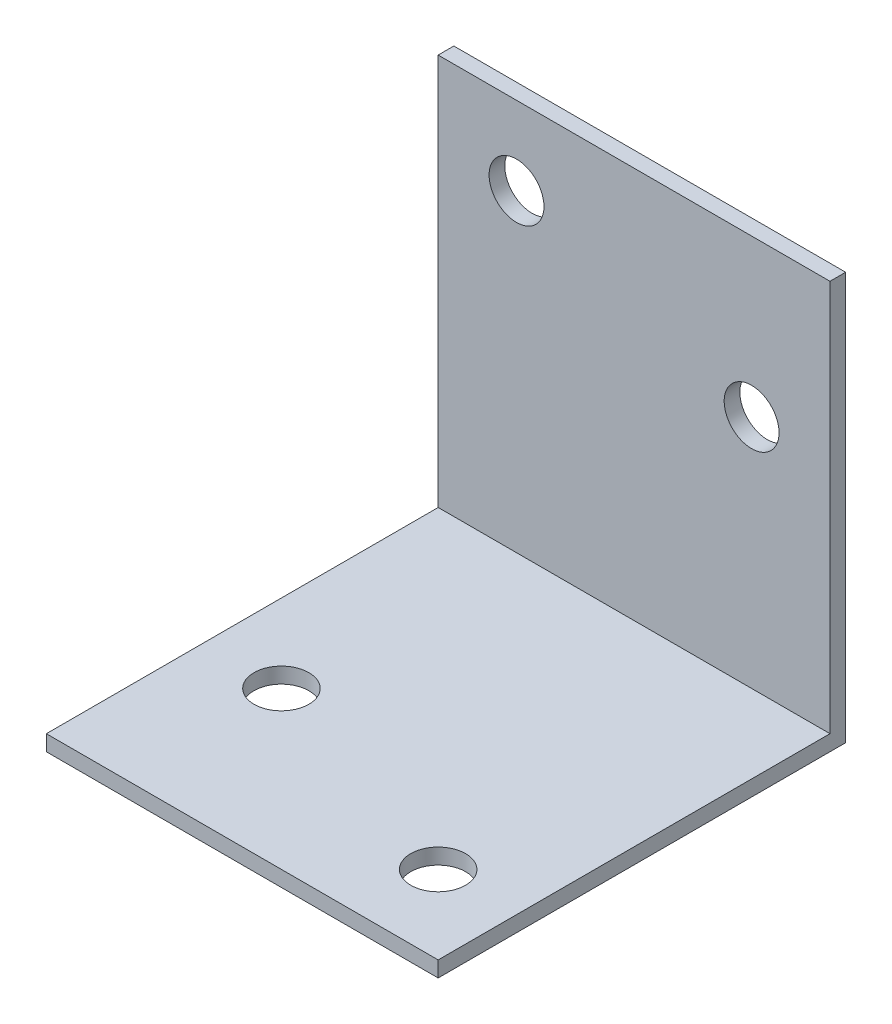
ISO-10303-21;
HEADER;
FILE_DESCRIPTION(('STEP AP214'),'2;1');
FILE_NAME('part.step','',(''),(''),'','','');
FILE_SCHEMA(('AUTOMOTIVE_DESIGN { 1 0 10303 214 1 1 1 1 }'));
ENDSEC;
DATA;
#1=APPLICATION_CONTEXT('core data for automotive mechanical design processes');
#2=APPLICATION_PROTOCOL_DEFINITION('international standard','automotive_design',2000,#1);
#3=PRODUCT_CONTEXT('',#1,'mechanical');
#4=PRODUCT('Part','Part','',(#3));
#5=PRODUCT_RELATED_PRODUCT_CATEGORY('part','',(#4));
#6=PRODUCT_DEFINITION_FORMATION('','',#4);
#7=PRODUCT_DEFINITION_CONTEXT('part definition',#1,'design');
#8=PRODUCT_DEFINITION('design','',#6,#7);
#9=PRODUCT_DEFINITION_SHAPE('','',#8);
#10=(LENGTH_UNIT() NAMED_UNIT(*) SI_UNIT(.MILLI.,.METRE.));
#11=(NAMED_UNIT(*) PLANE_ANGLE_UNIT() SI_UNIT($,.RADIAN.));
#12=(NAMED_UNIT(*) SI_UNIT($,.STERADIAN.) SOLID_ANGLE_UNIT());
#13=UNCERTAINTY_MEASURE_WITH_UNIT(LENGTH_MEASURE(1.E-05),#10,'distance_accuracy_value','');
#14=(GEOMETRIC_REPRESENTATION_CONTEXT(3) GLOBAL_UNCERTAINTY_ASSIGNED_CONTEXT((#13)) GLOBAL_UNIT_ASSIGNED_CONTEXT((#10,
#11,#12)) REPRESENTATION_CONTEXT('',''));
#15=CARTESIAN_POINT('',(0.,0.,0.));
#16=DIRECTION('',(0.,0.,1.));
#17=DIRECTION('',(1.,0.,0.));
#18=AXIS2_PLACEMENT_3D('',#15,#16,#17);
#19=CARTESIAN_POINT('',(0.,0.,1.));
#20=DIRECTION('',(0.,0.,1.));
#21=DIRECTION('',(1.,0.,0.));
#22=AXIS2_PLACEMENT_3D('',#19,#20,#21);
#23=PLANE('',#22);
#24=CARTESIAN_POINT('',(7.5,2.5,1.));
#25=DIRECTION('',(0.,0.,1.));
#26=DIRECTION('',(1.,0.,0.));
#27=AXIS2_PLACEMENT_3D('',#24,#25,#26);
#28=CIRCLE('',#27,1.75);
#29=CARTESIAN_POINT('',(9.25,2.5,1.));
#30=VERTEX_POINT('',#29);
#31=EDGE_CURVE('E105',#30,#30,#28,.T.);
#32=ORIENTED_EDGE('',*,*,#31,.F.);
#33=EDGE_LOOP('',(#32));
#34=FACE_BOUND('',#33,.T.);
#35=DIRECTION('',(0.,1.,0.));
#36=VECTOR('',#35,1.);
#37=CARTESIAN_POINT('',(12.5,12.5,1.));
#38=LINE('',#37,#36);
#39=CARTESIAN_POINT('',(12.5,-12.5,1.));
#40=VERTEX_POINT('',#39);
#41=CARTESIAN_POINT('',(12.5,12.5,1.));
#42=VERTEX_POINT('',#41);
#43=EDGE_CURVE('E90',#40,#42,#38,.T.);
#44=ORIENTED_EDGE('',*,*,#43,.T.);
#45=DIRECTION('',(-1.,0.,0.));
#46=VECTOR('',#45,1.);
#47=CARTESIAN_POINT('',(-12.5,12.5,1.));
#48=LINE('',#47,#46);
#49=CARTESIAN_POINT('',(-12.5,12.5,1.));
#50=VERTEX_POINT('',#49);
#51=EDGE_CURVE('E80',#42,#50,#48,.T.);
#52=ORIENTED_EDGE('',*,*,#51,.T.);
#53=DIRECTION('',(0.,-1.,0.));
#54=VECTOR('',#53,1.);
#55=CARTESIAN_POINT('',(-12.5,12.5,1.));
#56=LINE('',#55,#54);
#57=CARTESIAN_POINT('',(-12.5,-12.5,0.999999999999999));
#58=VERTEX_POINT('',#57);
#59=EDGE_CURVE('E89',#50,#58,#56,.T.);
#60=ORIENTED_EDGE('',*,*,#59,.T.);
#61=DIRECTION('',(1.,0.,0.));
#62=VECTOR('',#61,1.);
#63=CARTESIAN_POINT('',(-12.5,-12.5,1.));
#64=LINE('',#63,#62);
#65=EDGE_CURVE('E69',#58,#40,#64,.T.);
#66=ORIENTED_EDGE('',*,*,#65,.T.);
#67=EDGE_LOOP('',(#44,#52,#60,#66));
#68=FACE_BOUND('',#67,.T.);
#69=CARTESIAN_POINT('',(-7.5,7.5,1.));
#70=DIRECTION('',(0.,0.,1.));
#71=DIRECTION('',(1.,0.,0.));
#72=AXIS2_PLACEMENT_3D('',#69,#70,#71);
#73=CIRCLE('',#72,1.75);
#74=CARTESIAN_POINT('',(-5.75,7.5,1.));
#75=VERTEX_POINT('',#74);
#76=EDGE_CURVE('E294',#75,#75,#73,.T.);
#77=ORIENTED_EDGE('',*,*,#76,.F.);
#78=EDGE_LOOP('',(#77));
#79=FACE_BOUND('',#78,.T.);
#80=ADVANCED_FACE('F33',(#34,#68,#79),#23,.T.);
#81=CARTESIAN_POINT('',(0.,0.,0.));
#82=DIRECTION('',(0.,0.,1.));
#83=DIRECTION('',(1.,0.,0.));
#84=AXIS2_PLACEMENT_3D('',#81,#82,#83);
#85=PLANE('',#84);
#86=CARTESIAN_POINT('',(7.5,2.5,0.));
#87=DIRECTION('',(0.,0.,1.));
#88=DIRECTION('',(1.,0.,0.));
#89=AXIS2_PLACEMENT_3D('',#86,#87,#88);
#90=CIRCLE('',#89,1.75);
#91=CARTESIAN_POINT('',(9.25,2.5,0.));
#92=VERTEX_POINT('',#91);
#93=EDGE_CURVE('E109',#92,#92,#90,.T.);
#94=ORIENTED_EDGE('',*,*,#93,.T.);
#95=EDGE_LOOP('',(#94));
#96=FACE_BOUND('',#95,.T.);
#97=DIRECTION('',(0.,1.,0.));
#98=VECTOR('',#97,1.);
#99=CARTESIAN_POINT('',(12.5,12.5,0.));
#100=LINE('',#99,#98);
#101=CARTESIAN_POINT('',(12.5,-13.5,0.));
#102=VERTEX_POINT('',#101);
#103=CARTESIAN_POINT('',(12.5,12.5,0.));
#104=VERTEX_POINT('',#103);
#105=EDGE_CURVE('E98',#102,#104,#100,.T.);
#106=ORIENTED_EDGE('',*,*,#105,.F.);
#107=DIRECTION('',(1.,0.,0.));
#108=VECTOR('',#107,1.);
#109=CARTESIAN_POINT('',(-12.5,-13.5,0.));
#110=LINE('',#109,#108);
#111=CARTESIAN_POINT('',(-12.5,-13.5,0.));
#112=VERTEX_POINT('',#111);
#113=EDGE_CURVE('E152',#112,#102,#110,.T.);
#114=ORIENTED_EDGE('',*,*,#113,.F.);
#115=DIRECTION('',(0.,-1.,0.));
#116=VECTOR('',#115,1.);
#117=CARTESIAN_POINT('',(-12.5,12.5,0.));
#118=LINE('',#117,#116);
#119=CARTESIAN_POINT('',(-12.5,12.5,0.));
#120=VERTEX_POINT('',#119);
#121=EDGE_CURVE('E95',#120,#112,#118,.T.);
#122=ORIENTED_EDGE('',*,*,#121,.F.);
#123=DIRECTION('',(-1.,0.,0.));
#124=VECTOR('',#123,1.);
#125=CARTESIAN_POINT('',(-12.5,12.5,0.));
#126=LINE('',#125,#124);
#127=EDGE_CURVE('E65',#104,#120,#126,.T.);
#128=ORIENTED_EDGE('',*,*,#127,.F.);
#129=EDGE_LOOP('',(#106,#114,#122,#128));
#130=FACE_BOUND('',#129,.T.);
#131=CARTESIAN_POINT('',(-7.5,7.5,0.));
#132=DIRECTION('',(0.,0.,1.));
#133=DIRECTION('',(1.,0.,0.));
#134=AXIS2_PLACEMENT_3D('',#131,#132,#133);
#135=CIRCLE('',#134,1.75);
#136=CARTESIAN_POINT('',(-5.75,7.5,0.));
#137=VERTEX_POINT('',#136);
#138=EDGE_CURVE('E148',#137,#137,#135,.T.);
#139=ORIENTED_EDGE('',*,*,#138,.T.);
#140=EDGE_LOOP('',(#139));
#141=FACE_BOUND('',#140,.T.);
#142=ADVANCED_FACE('F187',(#96,#130,#141),#85,.F.);
#143=CARTESIAN_POINT('',(12.5,12.5,1.));
#144=DIRECTION('',(-1.,0.,0.));
#145=DIRECTION('',(0.,-1.,0.));
#146=AXIS2_PLACEMENT_3D('',#143,#144,#145);
#147=PLANE('',#146);
#148=ORIENTED_EDGE('',*,*,#105,.T.);
#149=DIRECTION('',(0.,0.,-1.));
#150=VECTOR('',#149,1.);
#151=CARTESIAN_POINT('',(12.5,12.5,1.));
#152=LINE('',#151,#150);
#153=EDGE_CURVE('E11',#42,#104,#152,.T.);
#154=ORIENTED_EDGE('',*,*,#153,.F.);
#155=ORIENTED_EDGE('',*,*,#43,.F.);
#156=DIRECTION('',(0.,0.,1.));
#157=VECTOR('',#156,1.);
#158=CARTESIAN_POINT('',(12.5,-12.5,0.));
#159=LINE('',#158,#157);
#160=CARTESIAN_POINT('',(12.5,-12.5,26.));
#161=VERTEX_POINT('',#160);
#162=EDGE_CURVE('E52',#40,#161,#159,.T.);
#163=ORIENTED_EDGE('',*,*,#162,.T.);
#164=DIRECTION('',(0.,1.,0.));
#165=VECTOR('',#164,1.);
#166=CARTESIAN_POINT('',(12.5,-13.5,26.));
#167=LINE('',#166,#165);
#168=CARTESIAN_POINT('',(12.5,-13.5,26.));
#169=VERTEX_POINT('',#168);
#170=EDGE_CURVE('E135',#169,#161,#167,.T.);
#171=ORIENTED_EDGE('',*,*,#170,.F.);
#172=DIRECTION('',(0.,0.,1.));
#173=VECTOR('',#172,1.);
#174=CARTESIAN_POINT('',(12.5,-13.5,0.));
#175=LINE('',#174,#173);
#176=EDGE_CURVE('E102',#102,#169,#175,.T.);
#177=ORIENTED_EDGE('',*,*,#176,.F.);
#178=EDGE_LOOP('',(#148,#154,#155,#163,#171,#177));
#179=FACE_BOUND('',#178,.T.);
#180=ADVANCED_FACE('F35',(#179),#147,.F.);
#181=CARTESIAN_POINT('',(-12.5,12.5,1.));
#182=DIRECTION('',(0.,-1.,0.));
#183=DIRECTION('',(0.,0.,-1.));
#184=AXIS2_PLACEMENT_3D('',#181,#182,#183);
#185=PLANE('',#184);
#186=ORIENTED_EDGE('',*,*,#127,.T.);
#187=DIRECTION('',(0.,0.,-1.));
#188=VECTOR('',#187,1.);
#189=CARTESIAN_POINT('',(-12.5,12.5,1.));
#190=LINE('',#189,#188);
#191=EDGE_CURVE('E43',#50,#120,#190,.T.);
#192=ORIENTED_EDGE('',*,*,#191,.F.);
#193=ORIENTED_EDGE('',*,*,#51,.F.);
#194=ORIENTED_EDGE('',*,*,#153,.T.);
#195=EDGE_LOOP('',(#186,#192,#193,#194));
#196=FACE_BOUND('',#195,.T.);
#197=ADVANCED_FACE('F82',(#196),#185,.F.);
#198=CARTESIAN_POINT('',(-12.5,12.5,1.));
#199=DIRECTION('',(1.,0.,0.));
#200=DIRECTION('',(0.,1.,0.));
#201=AXIS2_PLACEMENT_3D('',#198,#199,#200);
#202=PLANE('',#201);
#203=ORIENTED_EDGE('',*,*,#121,.T.);
#204=DIRECTION('',(0.,0.,-1.));
#205=VECTOR('',#204,1.);
#206=CARTESIAN_POINT('',(-12.5,-13.5,0.));
#207=LINE('',#206,#205);
#208=CARTESIAN_POINT('',(-12.5,-13.5,26.));
#209=VERTEX_POINT('',#208);
#210=EDGE_CURVE('E146',#209,#112,#207,.T.);
#211=ORIENTED_EDGE('',*,*,#210,.F.);
#212=DIRECTION('',(0.,1.,0.));
#213=VECTOR('',#212,1.);
#214=CARTESIAN_POINT('',(-12.5,-13.5,26.));
#215=LINE('',#214,#213);
#216=CARTESIAN_POINT('',(-12.5,-12.5,26.));
#217=VERTEX_POINT('',#216);
#218=EDGE_CURVE('E125',#209,#217,#215,.T.);
#219=ORIENTED_EDGE('',*,*,#218,.T.);
#220=DIRECTION('',(0.,0.,-1.));
#221=VECTOR('',#220,1.);
#222=CARTESIAN_POINT('',(-12.5,-12.5,0.));
#223=LINE('',#222,#221);
#224=EDGE_CURVE('E122',#217,#58,#223,.T.);
#225=ORIENTED_EDGE('',*,*,#224,.T.);
#226=ORIENTED_EDGE('',*,*,#59,.F.);
#227=ORIENTED_EDGE('',*,*,#191,.T.);
#228=EDGE_LOOP('',(#203,#211,#219,#225,#226,#227));
#229=FACE_BOUND('',#228,.T.);
#230=ADVANCED_FACE('F120',(#229),#202,.F.);
#231=CARTESIAN_POINT('',(7.5,2.5,1.));
#232=DIRECTION('',(0.,0.,-1.));
#233=DIRECTION('',(-1.,0.,0.));
#234=AXIS2_PLACEMENT_3D('',#231,#232,#233);
#235=CYLINDRICAL_SURFACE('',#234,1.75);
#236=ORIENTED_EDGE('',*,*,#31,.T.);
#237=EDGE_LOOP('',(#236));
#238=FACE_BOUND('',#237,.T.);
#239=ORIENTED_EDGE('',*,*,#93,.F.);
#240=EDGE_LOOP('',(#239));
#241=FACE_BOUND('',#240,.T.);
#242=ADVANCED_FACE('F197',(#238,#241),#235,.F.);
#243=CARTESIAN_POINT('',(-7.5,7.5,1.));
#244=DIRECTION('',(0.,0.,-1.));
#245=DIRECTION('',(-1.,0.,0.));
#246=AXIS2_PLACEMENT_3D('',#243,#244,#245);
#247=CYLINDRICAL_SURFACE('',#246,1.75);
#248=ORIENTED_EDGE('',*,*,#76,.T.);
#249=EDGE_LOOP('',(#248));
#250=FACE_BOUND('',#249,.T.);
#251=ORIENTED_EDGE('',*,*,#138,.F.);
#252=EDGE_LOOP('',(#251));
#253=FACE_BOUND('',#252,.T.);
#254=ADVANCED_FACE('F181',(#250,#253),#247,.F.);
#255=CARTESIAN_POINT('',(0.,-12.5,0.));
#256=DIRECTION('',(0.,1.,0.));
#257=DIRECTION('',(0.,0.,1.));
#258=AXIS2_PLACEMENT_3D('',#255,#256,#257);
#259=PLANE('',#258);
#260=CARTESIAN_POINT('',(-7.5,-12.5,16.));
#261=DIRECTION('',(0.,-1.,0.));
#262=DIRECTION('',(0.,0.,-1.));
#263=AXIS2_PLACEMENT_3D('',#260,#261,#262);
#264=CIRCLE('',#263,1.75);
#265=CARTESIAN_POINT('',(-7.5,-12.5,14.25));
#266=VERTEX_POINT('',#265);
#267=EDGE_CURVE('E159',#266,#266,#264,.T.);
#268=ORIENTED_EDGE('',*,*,#267,.T.);
#269=EDGE_LOOP('',(#268));
#270=FACE_BOUND('',#269,.T.);
#271=CARTESIAN_POINT('',(7.5,-12.5,21.));
#272=DIRECTION('',(0.,-1.,0.));
#273=DIRECTION('',(0.,0.,-1.));
#274=AXIS2_PLACEMENT_3D('',#271,#272,#273);
#275=CIRCLE('',#274,1.75);
#276=CARTESIAN_POINT('',(7.5,-12.5,19.25));
#277=VERTEX_POINT('',#276);
#278=EDGE_CURVE('E131',#277,#277,#275,.T.);
#279=ORIENTED_EDGE('',*,*,#278,.T.);
#280=EDGE_LOOP('',(#279));
#281=FACE_BOUND('',#280,.T.);
#282=ORIENTED_EDGE('',*,*,#65,.F.);
#283=ORIENTED_EDGE('',*,*,#224,.F.);
#284=DIRECTION('',(-1.,0.,0.));
#285=VECTOR('',#284,1.);
#286=CARTESIAN_POINT('',(-12.5,-12.5,26.));
#287=LINE('',#286,#285);
#288=EDGE_CURVE('E128',#161,#217,#287,.T.);
#289=ORIENTED_EDGE('',*,*,#288,.F.);
#290=ORIENTED_EDGE('',*,*,#162,.F.);
#291=EDGE_LOOP('',(#282,#283,#289,#290));
#292=FACE_BOUND('',#291,.T.);
#293=ADVANCED_FACE('F171',(#270,#281,#292),#259,.T.);
#294=CARTESIAN_POINT('',(0.,-13.5,0.));
#295=DIRECTION('',(0.,1.,0.));
#296=DIRECTION('',(0.,0.,1.));
#297=AXIS2_PLACEMENT_3D('',#294,#295,#296);
#298=PLANE('',#297);
#299=CARTESIAN_POINT('',(7.5,-13.5,21.));
#300=DIRECTION('',(0.,-1.,0.));
#301=DIRECTION('',(0.,0.,-1.));
#302=AXIS2_PLACEMENT_3D('',#299,#300,#301);
#303=CIRCLE('',#302,1.75);
#304=CARTESIAN_POINT('',(7.5,-13.5,19.25));
#305=VERTEX_POINT('',#304);
#306=EDGE_CURVE('E126',#305,#305,#303,.T.);
#307=ORIENTED_EDGE('',*,*,#306,.F.);
#308=EDGE_LOOP('',(#307));
#309=FACE_BOUND('',#308,.T.);
#310=ORIENTED_EDGE('',*,*,#210,.T.);
#311=ORIENTED_EDGE('',*,*,#113,.T.);
#312=ORIENTED_EDGE('',*,*,#176,.T.);
#313=DIRECTION('',(-1.,0.,0.));
#314=VECTOR('',#313,1.);
#315=CARTESIAN_POINT('',(-12.5,-13.5,26.));
#316=LINE('',#315,#314);
#317=EDGE_CURVE('E141',#169,#209,#316,.T.);
#318=ORIENTED_EDGE('',*,*,#317,.T.);
#319=EDGE_LOOP('',(#310,#311,#312,#318));
#320=FACE_BOUND('',#319,.T.);
#321=CARTESIAN_POINT('',(-7.5,-13.5,16.));
#322=DIRECTION('',(0.,-1.,0.));
#323=DIRECTION('',(0.,0.,-1.));
#324=AXIS2_PLACEMENT_3D('',#321,#322,#323);
#325=CIRCLE('',#324,1.75);
#326=CARTESIAN_POINT('',(-7.5,-13.5,14.25));
#327=VERTEX_POINT('',#326);
#328=EDGE_CURVE('E157',#327,#327,#325,.T.);
#329=ORIENTED_EDGE('',*,*,#328,.F.);
#330=EDGE_LOOP('',(#329));
#331=FACE_BOUND('',#330,.T.);
#332=ADVANCED_FACE('F168',(#309,#320,#331),#298,.F.);
#333=CARTESIAN_POINT('',(-12.5,-13.5,26.));
#334=DIRECTION('',(0.,0.,-1.));
#335=DIRECTION('',(-1.,0.,0.));
#336=AXIS2_PLACEMENT_3D('',#333,#334,#335);
#337=PLANE('',#336);
#338=ORIENTED_EDGE('',*,*,#288,.T.);
#339=ORIENTED_EDGE('',*,*,#218,.F.);
#340=ORIENTED_EDGE('',*,*,#317,.F.);
#341=ORIENTED_EDGE('',*,*,#170,.T.);
#342=EDGE_LOOP('',(#338,#339,#340,#341));
#343=FACE_BOUND('',#342,.T.);
#344=ADVANCED_FACE('F170',(#343),#337,.F.);
#345=CARTESIAN_POINT('',(7.5,-13.5,21.));
#346=DIRECTION('',(0.,1.,0.));
#347=DIRECTION('',(0.,0.,1.));
#348=AXIS2_PLACEMENT_3D('',#345,#346,#347);
#349=CYLINDRICAL_SURFACE('',#348,1.75);
#350=ORIENTED_EDGE('',*,*,#306,.T.);
#351=EDGE_LOOP('',(#350));
#352=FACE_BOUND('',#351,.T.);
#353=ORIENTED_EDGE('',*,*,#278,.F.);
#354=EDGE_LOOP('',(#353));
#355=FACE_BOUND('',#354,.T.);
#356=ADVANCED_FACE('F178',(#352,#355),#349,.F.);
#357=CARTESIAN_POINT('',(-7.5,-13.5,16.));
#358=DIRECTION('',(0.,1.,0.));
#359=DIRECTION('',(0.,0.,1.));
#360=AXIS2_PLACEMENT_3D('',#357,#358,#359);
#361=CYLINDRICAL_SURFACE('',#360,1.75);
#362=ORIENTED_EDGE('',*,*,#328,.T.);
#363=EDGE_LOOP('',(#362));
#364=FACE_BOUND('',#363,.T.);
#365=ORIENTED_EDGE('',*,*,#267,.F.);
#366=EDGE_LOOP('',(#365));
#367=FACE_BOUND('',#366,.T.);
#368=ADVANCED_FACE('F165',(#364,#367),#361,.F.);
#369=CLOSED_SHELL('',(#80,#142,#180,#197,#230,#242,#254,#293,#332,#344,#356,#368));
#370=MANIFOLD_SOLID_BREP('B2',#369);
#371=ADVANCED_BREP_SHAPE_REPRESENTATION('',(#18,#370),#14);
#372=SHAPE_DEFINITION_REPRESENTATION(#9,#371);
ENDSEC;
END-ISO-10303-21;
